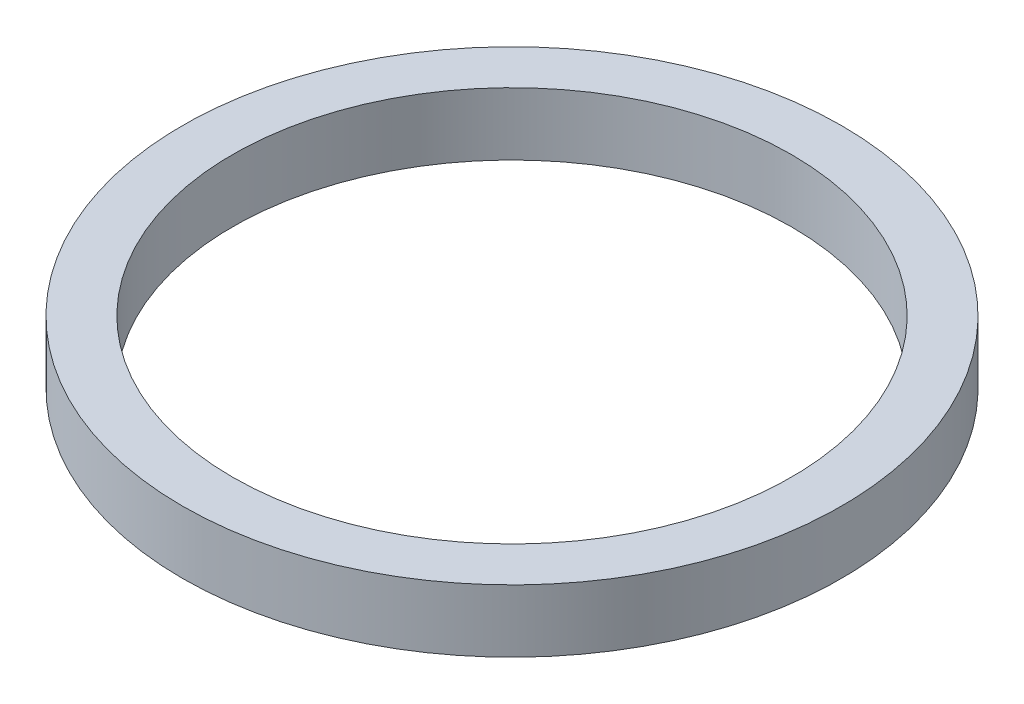
ISO-10303-21;
HEADER;
FILE_DESCRIPTION(('STEP AP214'),'2;1');
FILE_NAME('part.step','',(''),(''),'','','');
FILE_SCHEMA(('AUTOMOTIVE_DESIGN { 1 0 10303 214 1 1 1 1 }'));
ENDSEC;
DATA;
#1=APPLICATION_CONTEXT('core data for automotive mechanical design processes');
#2=APPLICATION_PROTOCOL_DEFINITION('international standard','automotive_design',2000,#1);
#3=PRODUCT_CONTEXT('',#1,'mechanical');
#4=PRODUCT('Part','Part','',(#3));
#5=PRODUCT_RELATED_PRODUCT_CATEGORY('part','',(#4));
#6=PRODUCT_DEFINITION_FORMATION('','',#4);
#7=PRODUCT_DEFINITION_CONTEXT('part definition',#1,'design');
#8=PRODUCT_DEFINITION('design','',#6,#7);
#9=PRODUCT_DEFINITION_SHAPE('','',#8);
#10=(LENGTH_UNIT() NAMED_UNIT(*) SI_UNIT(.MILLI.,.METRE.));
#11=(NAMED_UNIT(*) PLANE_ANGLE_UNIT() SI_UNIT($,.RADIAN.));
#12=(NAMED_UNIT(*) SI_UNIT($,.STERADIAN.) SOLID_ANGLE_UNIT());
#13=UNCERTAINTY_MEASURE_WITH_UNIT(LENGTH_MEASURE(1.E-05),#10,'distance_accuracy_value','');
#14=(GEOMETRIC_REPRESENTATION_CONTEXT(3) GLOBAL_UNCERTAINTY_ASSIGNED_CONTEXT((#13)) GLOBAL_UNIT_ASSIGNED_CONTEXT((#10,
#11,#12)) REPRESENTATION_CONTEXT('',''));
#15=CARTESIAN_POINT('',(0.,0.,0.));
#16=DIRECTION('',(0.,0.,1.));
#17=DIRECTION('',(1.,0.,0.));
#18=AXIS2_PLACEMENT_3D('',#15,#16,#17);
#19=CARTESIAN_POINT('',(0.,0.,0.));
#20=DIRECTION('',(0.,-1.,0.));
#21=DIRECTION('',(0.,0.,-1.));
#22=AXIS2_PLACEMENT_3D('',#19,#20,#21);
#23=CYLINDRICAL_SURFACE('',#22,16.7005);
#24=CARTESIAN_POINT('',(0.,-1.5875,0.));
#25=DIRECTION('',(0.,-1.,0.));
#26=DIRECTION('',(0.,0.,-1.));
#27=AXIS2_PLACEMENT_3D('',#24,#25,#26);
#28=CIRCLE('',#27,16.7005);
#29=CARTESIAN_POINT('',(0.,-1.5875,-16.7005));
#30=VERTEX_POINT('',#29);
#31=EDGE_CURVE('E10',#30,#30,#28,.T.);
#32=ORIENTED_EDGE('',*,*,#31,.F.);
#33=EDGE_LOOP('',(#32));
#34=FACE_BOUND('',#33,.T.);
#35=CARTESIAN_POINT('',(0.,1.5875,0.));
#36=DIRECTION('',(0.,-1.,0.));
#37=DIRECTION('',(0.,0.,-1.));
#38=AXIS2_PLACEMENT_3D('',#35,#36,#37);
#39=CIRCLE('',#38,16.7005);
#40=CARTESIAN_POINT('',(0.,1.5875,-16.7005));
#41=VERTEX_POINT('',#40);
#42=EDGE_CURVE('E51',#41,#41,#39,.T.);
#43=ORIENTED_EDGE('',*,*,#42,.T.);
#44=EDGE_LOOP('',(#43));
#45=FACE_BOUND('',#44,.T.);
#46=ADVANCED_FACE('F37',(#34,#45),#23,.T.);
#47=CARTESIAN_POINT('',(-16.7005,-1.5875,0.));
#48=DIRECTION('',(0.,1.,0.));
#49=DIRECTION('',(0.,0.,1.));
#50=AXIS2_PLACEMENT_3D('',#47,#48,#49);
#51=PLANE('',#50);
#52=CARTESIAN_POINT('',(0.,-1.5875,0.));
#53=DIRECTION('',(0.,-1.,0.));
#54=DIRECTION('',(0.,0.,-1.));
#55=AXIS2_PLACEMENT_3D('',#52,#53,#54);
#56=CIRCLE('',#55,14.1605);
#57=CARTESIAN_POINT('',(0.,-1.5875,-14.1605));
#58=VERTEX_POINT('',#57);
#59=EDGE_CURVE('E43',#58,#58,#56,.T.);
#60=ORIENTED_EDGE('',*,*,#59,.F.);
#61=EDGE_LOOP('',(#60));
#62=FACE_BOUND('',#61,.T.);
#63=ORIENTED_EDGE('',*,*,#31,.T.);
#64=EDGE_LOOP('',(#63));
#65=FACE_BOUND('',#64,.T.);
#66=ADVANCED_FACE('F66',(#62,#65),#51,.F.);
#67=CARTESIAN_POINT('',(0.,0.,0.));
#68=DIRECTION('',(0.,-1.,0.));
#69=DIRECTION('',(0.,0.,-1.));
#70=AXIS2_PLACEMENT_3D('',#67,#68,#69);
#71=CYLINDRICAL_SURFACE('',#70,14.1605);
#72=CARTESIAN_POINT('',(0.,1.5875,0.));
#73=DIRECTION('',(0.,-1.,0.));
#74=DIRECTION('',(0.,0.,-1.));
#75=AXIS2_PLACEMENT_3D('',#72,#73,#74);
#76=CIRCLE('',#75,14.1605);
#77=CARTESIAN_POINT('',(0.,1.5875,-14.1605));
#78=VERTEX_POINT('',#77);
#79=EDGE_CURVE('E47',#78,#78,#76,.T.);
#80=ORIENTED_EDGE('',*,*,#79,.F.);
#81=EDGE_LOOP('',(#80));
#82=FACE_BOUND('',#81,.T.);
#83=ORIENTED_EDGE('',*,*,#59,.T.);
#84=EDGE_LOOP('',(#83));
#85=FACE_BOUND('',#84,.T.);
#86=ADVANCED_FACE('F61',(#82,#85),#71,.F.);
#87=CARTESIAN_POINT('',(-16.7005,1.5875,0.));
#88=DIRECTION('',(0.,-1.,0.));
#89=DIRECTION('',(0.,0.,-1.));
#90=AXIS2_PLACEMENT_3D('',#87,#88,#89);
#91=PLANE('',#90);
#92=ORIENTED_EDGE('',*,*,#42,.F.);
#93=EDGE_LOOP('',(#92));
#94=FACE_BOUND('',#93,.T.);
#95=ORIENTED_EDGE('',*,*,#79,.T.);
#96=EDGE_LOOP('',(#95));
#97=FACE_BOUND('',#96,.T.);
#98=ADVANCED_FACE('F58',(#94,#97),#91,.F.);
#99=CLOSED_SHELL('',(#46,#66,#86,#98));
#100=MANIFOLD_SOLID_BREP('B2',#99);
#101=ADVANCED_BREP_SHAPE_REPRESENTATION('',(#18,#100),#14);
#102=SHAPE_DEFINITION_REPRESENTATION(#9,#101);
ENDSEC;
END-ISO-10303-21;
